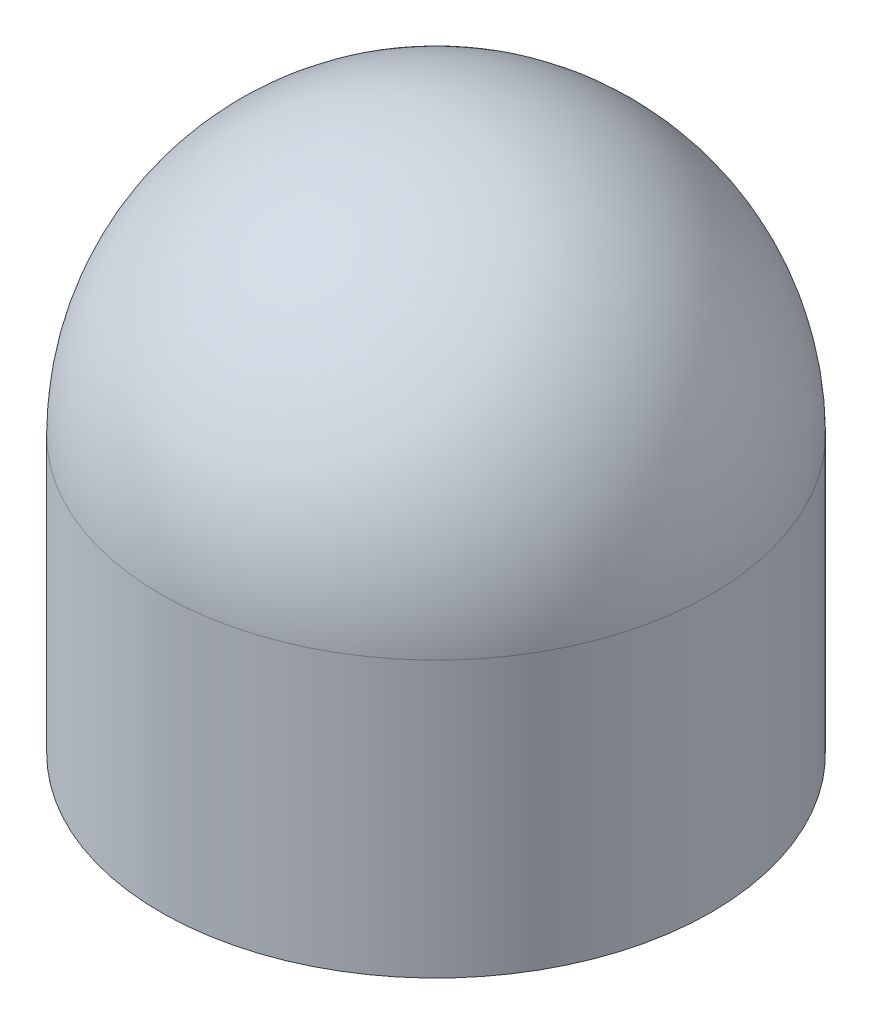
ISO-10303-21;
HEADER;
FILE_DESCRIPTION(('STEP AP214'),'2;1');
FILE_NAME('part.step','',(''),(''),'','','');
FILE_SCHEMA(('AUTOMOTIVE_DESIGN { 1 0 10303 214 1 1 1 1 }'));
ENDSEC;
DATA;
#1=APPLICATION_CONTEXT('core data for automotive mechanical design processes');
#2=APPLICATION_PROTOCOL_DEFINITION('international standard','automotive_design',2000,#1);
#3=PRODUCT_CONTEXT('',#1,'mechanical');
#4=PRODUCT('Part','Part','',(#3));
#5=PRODUCT_RELATED_PRODUCT_CATEGORY('part','',(#4));
#6=PRODUCT_DEFINITION_FORMATION('','',#4);
#7=PRODUCT_DEFINITION_CONTEXT('part definition',#1,'design');
#8=PRODUCT_DEFINITION('design','',#6,#7);
#9=PRODUCT_DEFINITION_SHAPE('','',#8);
#10=(LENGTH_UNIT() NAMED_UNIT(*) SI_UNIT(.MILLI.,.METRE.));
#11=(NAMED_UNIT(*) PLANE_ANGLE_UNIT() SI_UNIT($,.RADIAN.));
#12=(NAMED_UNIT(*) SI_UNIT($,.STERADIAN.) SOLID_ANGLE_UNIT());
#13=UNCERTAINTY_MEASURE_WITH_UNIT(LENGTH_MEASURE(1.E-05),#10,'distance_accuracy_value','');
#14=(GEOMETRIC_REPRESENTATION_CONTEXT(3) GLOBAL_UNCERTAINTY_ASSIGNED_CONTEXT((#13)) GLOBAL_UNIT_ASSIGNED_CONTEXT((#10,
#11,#12)) REPRESENTATION_CONTEXT('',''));
#15=CARTESIAN_POINT('',(0.,0.,0.));
#16=DIRECTION('',(0.,0.,1.));
#17=DIRECTION('',(1.,0.,0.));
#18=AXIS2_PLACEMENT_3D('',#15,#16,#17);
#19=CARTESIAN_POINT('',(0.,0.,0.));
#20=DIRECTION('',(0.,-1.,0.));
#21=DIRECTION('',(1.,0.,0.));
#22=AXIS2_PLACEMENT_3D('',#19,#20,#21);
#23=PLANE('',#22);
#24=CARTESIAN_POINT('',(0.,0.,0.));
#25=DIRECTION('',(0.,-1.,0.));
#26=DIRECTION('',(1.,0.,0.));
#27=AXIS2_PLACEMENT_3D('',#24,#25,#26);
#28=CIRCLE('',#27,40.);
#29=CARTESIAN_POINT('',(40.,0.,0.));
#30=VERTEX_POINT('',#29);
#31=EDGE_CURVE('E10',#30,#30,#28,.T.);
#32=ORIENTED_EDGE('',*,*,#31,.T.);
#33=EDGE_LOOP('',(#32));
#34=FACE_BOUND('',#33,.T.);
#35=ADVANCED_FACE('F30',(#34),#23,.T.);
#36=CARTESIAN_POINT('',(0.,0.,0.));
#37=DIRECTION('',(0.,-1.,0.));
#38=DIRECTION('',(1.,0.,0.));
#39=AXIS2_PLACEMENT_3D('',#36,#37,#38);
#40=CYLINDRICAL_SURFACE('',#39,40.);
#41=CARTESIAN_POINT('',(0.,40.,0.));
#42=DIRECTION('',(0.,-1.,0.));
#43=DIRECTION('',(1.,0.,0.));
#44=AXIS2_PLACEMENT_3D('',#41,#42,#43);
#45=CIRCLE('',#44,40.);
#46=CARTESIAN_POINT('',(40.,40.,0.));
#47=VERTEX_POINT('',#46);
#48=EDGE_CURVE('E36',#47,#47,#45,.T.);
#49=ORIENTED_EDGE('',*,*,#48,.T.);
#50=EDGE_LOOP('',(#49));
#51=FACE_BOUND('',#50,.T.);
#52=ORIENTED_EDGE('',*,*,#31,.F.);
#53=EDGE_LOOP('',(#52));
#54=FACE_BOUND('',#53,.T.);
#55=ADVANCED_FACE('F42',(#51,#54),#40,.T.);
#56=CARTESIAN_POINT('',(0.,40.,0.));
#57=DIRECTION('',(0.,-1.,0.));
#58=DIRECTION('',(1.,0.,0.));
#59=AXIS2_PLACEMENT_3D('',#56,#57,#58);
#60=SPHERICAL_SURFACE('',#59,40.);
#61=ORIENTED_EDGE('',*,*,#48,.F.);
#62=EDGE_LOOP('',(#61));
#63=FACE_BOUND('',#62,.T.);
#64=ADVANCED_FACE('F45',(#63),#60,.T.);
#65=CLOSED_SHELL('',(#35,#55,#64));
#66=MANIFOLD_SOLID_BREP('B2',#65);
#67=ADVANCED_BREP_SHAPE_REPRESENTATION('',(#18,#66),#14);
#68=SHAPE_DEFINITION_REPRESENTATION(#9,#67);
ENDSEC;
END-ISO-10303-21;
